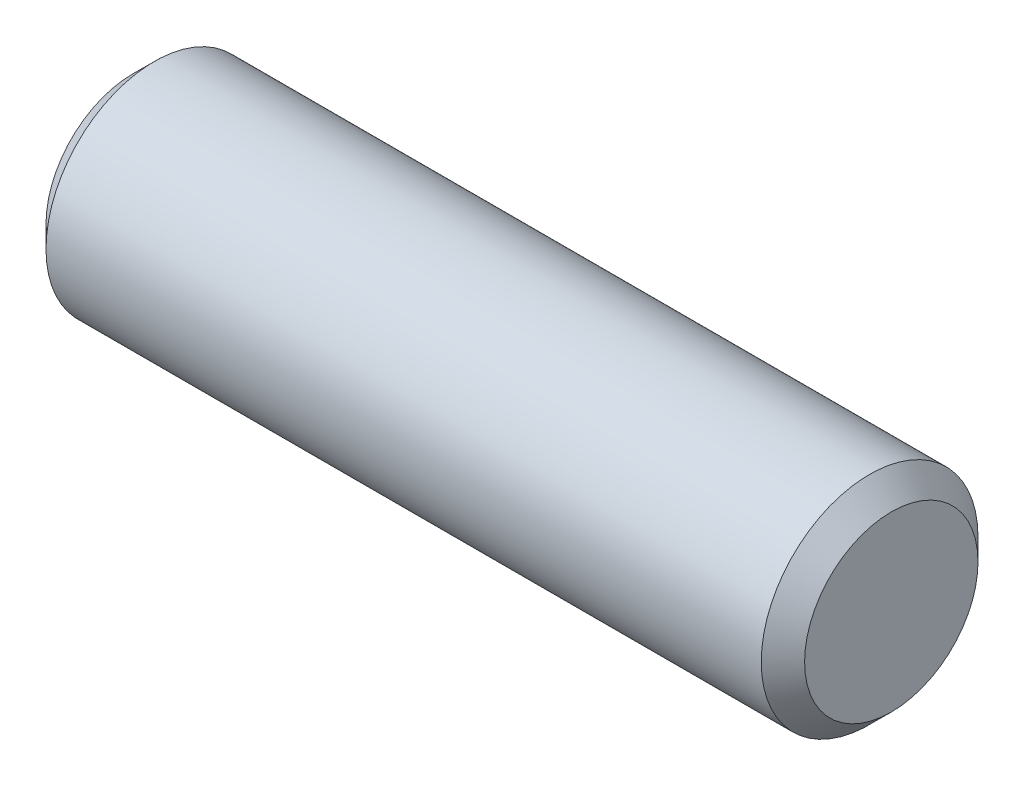
ISO-10303-21;
HEADER;
FILE_DESCRIPTION(('STEP AP214'),'2;1');
FILE_NAME('part.step','',(''),(''),'','','');
FILE_SCHEMA(('AUTOMOTIVE_DESIGN { 1 0 10303 214 1 1 1 1 }'));
ENDSEC;
DATA;
#1=APPLICATION_CONTEXT('core data for automotive mechanical design processes');
#2=APPLICATION_PROTOCOL_DEFINITION('international standard','automotive_design',2000,#1);
#3=PRODUCT_CONTEXT('',#1,'mechanical');
#4=PRODUCT('Part','Part','',(#3));
#5=PRODUCT_RELATED_PRODUCT_CATEGORY('part','',(#4));
#6=PRODUCT_DEFINITION_FORMATION('','',#4);
#7=PRODUCT_DEFINITION_CONTEXT('part definition',#1,'design');
#8=PRODUCT_DEFINITION('design','',#6,#7);
#9=PRODUCT_DEFINITION_SHAPE('','',#8);
#10=(LENGTH_UNIT() NAMED_UNIT(*) SI_UNIT(.MILLI.,.METRE.));
#11=(NAMED_UNIT(*) PLANE_ANGLE_UNIT() SI_UNIT($,.RADIAN.));
#12=(NAMED_UNIT(*) SI_UNIT($,.STERADIAN.) SOLID_ANGLE_UNIT());
#13=UNCERTAINTY_MEASURE_WITH_UNIT(LENGTH_MEASURE(1.E-05),#10,'distance_accuracy_value','');
#14=(GEOMETRIC_REPRESENTATION_CONTEXT(3) GLOBAL_UNCERTAINTY_ASSIGNED_CONTEXT((#13)) GLOBAL_UNIT_ASSIGNED_CONTEXT((#10,
#11,#12)) REPRESENTATION_CONTEXT('',''));
#15=CARTESIAN_POINT('',(0.,0.,0.));
#16=DIRECTION('',(0.,0.,1.));
#17=DIRECTION('',(1.,0.,0.));
#18=AXIS2_PLACEMENT_3D('',#15,#16,#17);
#19=CARTESIAN_POINT('',(-11.1125,0.,0.));
#20=DIRECTION('',(1.,0.,0.));
#21=DIRECTION('',(0.,0.,-1.));
#22=AXIS2_PLACEMENT_3D('',#19,#20,#21);
#23=CYLINDRICAL_SURFACE('',#22,3.175);
#24=CARTESIAN_POINT('',(10.4775,0.,0.));
#25=DIRECTION('',(1.,0.,0.));
#26=DIRECTION('',(0.,0.,-1.));
#27=AXIS2_PLACEMENT_3D('',#24,#25,#26);
#28=CIRCLE('',#27,3.175);
#29=CARTESIAN_POINT('',(10.4775,0.,-3.175));
#30=VERTEX_POINT('',#29);
#31=EDGE_CURVE('E42',#30,#30,#28,.F.);
#32=ORIENTED_EDGE('',*,*,#31,.T.);
#33=EDGE_LOOP('',(#32));
#34=FACE_BOUND('',#33,.T.);
#35=CARTESIAN_POINT('',(-10.4775,0.,0.));
#36=DIRECTION('',(1.,0.,0.));
#37=DIRECTION('',(0.,0.,-1.));
#38=AXIS2_PLACEMENT_3D('',#35,#36,#37);
#39=CIRCLE('',#38,3.175);
#40=CARTESIAN_POINT('',(-10.4775,0.,-3.175));
#41=VERTEX_POINT('',#40);
#42=EDGE_CURVE('E48',#41,#41,#39,.T.);
#43=ORIENTED_EDGE('',*,*,#42,.T.);
#44=EDGE_LOOP('',(#43));
#45=FACE_BOUND('',#44,.T.);
#46=ADVANCED_FACE('F34',(#34,#45),#23,.T.);
#47=CARTESIAN_POINT('',(-11.1125,0.,0.));
#48=DIRECTION('',(1.,0.,0.));
#49=DIRECTION('',(0.,0.,-1.));
#50=AXIS2_PLACEMENT_3D('',#47,#48,#49);
#51=PLANE('',#50);
#52=CARTESIAN_POINT('',(-11.1125,0.,0.));
#53=DIRECTION('',(1.,0.,0.));
#54=DIRECTION('',(0.,0.,-1.));
#55=AXIS2_PLACEMENT_3D('',#52,#53,#54);
#56=CIRCLE('',#55,2.53999999999999);
#57=CARTESIAN_POINT('',(-11.1125,0.,-2.53999999999999));
#58=VERTEX_POINT('',#57);
#59=EDGE_CURVE('E10',#58,#58,#56,.F.);
#60=ORIENTED_EDGE('',*,*,#59,.T.);
#61=EDGE_LOOP('',(#60));
#62=FACE_BOUND('',#61,.T.);
#63=ADVANCED_FACE('F69',(#62),#51,.F.);
#64=CARTESIAN_POINT('',(11.1125,0.,0.));
#65=DIRECTION('',(1.,0.,0.));
#66=DIRECTION('',(0.,0.,-1.));
#67=AXIS2_PLACEMENT_3D('',#64,#65,#66);
#68=PLANE('',#67);
#69=CARTESIAN_POINT('',(11.1125,0.,0.));
#70=DIRECTION('',(1.,0.,0.));
#71=DIRECTION('',(0.,0.,-1.));
#72=AXIS2_PLACEMENT_3D('',#69,#70,#71);
#73=CIRCLE('',#72,2.54);
#74=CARTESIAN_POINT('',(11.1125,0.,-2.54));
#75=VERTEX_POINT('',#74);
#76=EDGE_CURVE('E53',#75,#75,#73,.T.);
#77=ORIENTED_EDGE('',*,*,#76,.T.);
#78=EDGE_LOOP('',(#77));
#79=FACE_BOUND('',#78,.T.);
#80=ADVANCED_FACE('F59',(#79),#68,.T.);
#81=CARTESIAN_POINT('',(11.1125,0.,0.));
#82=DIRECTION('',(-1.,0.,0.));
#83=DIRECTION('',(0.,0.,1.));
#84=AXIS2_PLACEMENT_3D('',#81,#82,#83);
#85=CONICAL_SURFACE('',#84,2.54,0.785398163397445);
#86=ORIENTED_EDGE('',*,*,#31,.F.);
#87=EDGE_LOOP('',(#86));
#88=FACE_BOUND('',#87,.T.);
#89=ORIENTED_EDGE('',*,*,#76,.F.);
#90=EDGE_LOOP('',(#89));
#91=FACE_BOUND('',#90,.T.);
#92=ADVANCED_FACE('F61',(#88,#91),#85,.T.);
#93=CARTESIAN_POINT('',(-10.4775,0.,0.));
#94=DIRECTION('',(1.,0.,0.));
#95=DIRECTION('',(0.,0.,-1.));
#96=AXIS2_PLACEMENT_3D('',#93,#94,#95);
#97=CONICAL_SURFACE('',#96,3.175,0.78539816339745);
#98=ORIENTED_EDGE('',*,*,#59,.F.);
#99=EDGE_LOOP('',(#98));
#100=FACE_BOUND('',#99,.T.);
#101=ORIENTED_EDGE('',*,*,#42,.F.);
#102=EDGE_LOOP('',(#101));
#103=FACE_BOUND('',#102,.T.);
#104=ADVANCED_FACE('F36',(#100,#103),#97,.T.);
#105=CLOSED_SHELL('',(#46,#63,#80,#92,#104));
#106=MANIFOLD_SOLID_BREP('B2',#105);
#107=ADVANCED_BREP_SHAPE_REPRESENTATION('',(#18,#106),#14);
#108=SHAPE_DEFINITION_REPRESENTATION(#9,#107);
ENDSEC;
END-ISO-10303-21;
